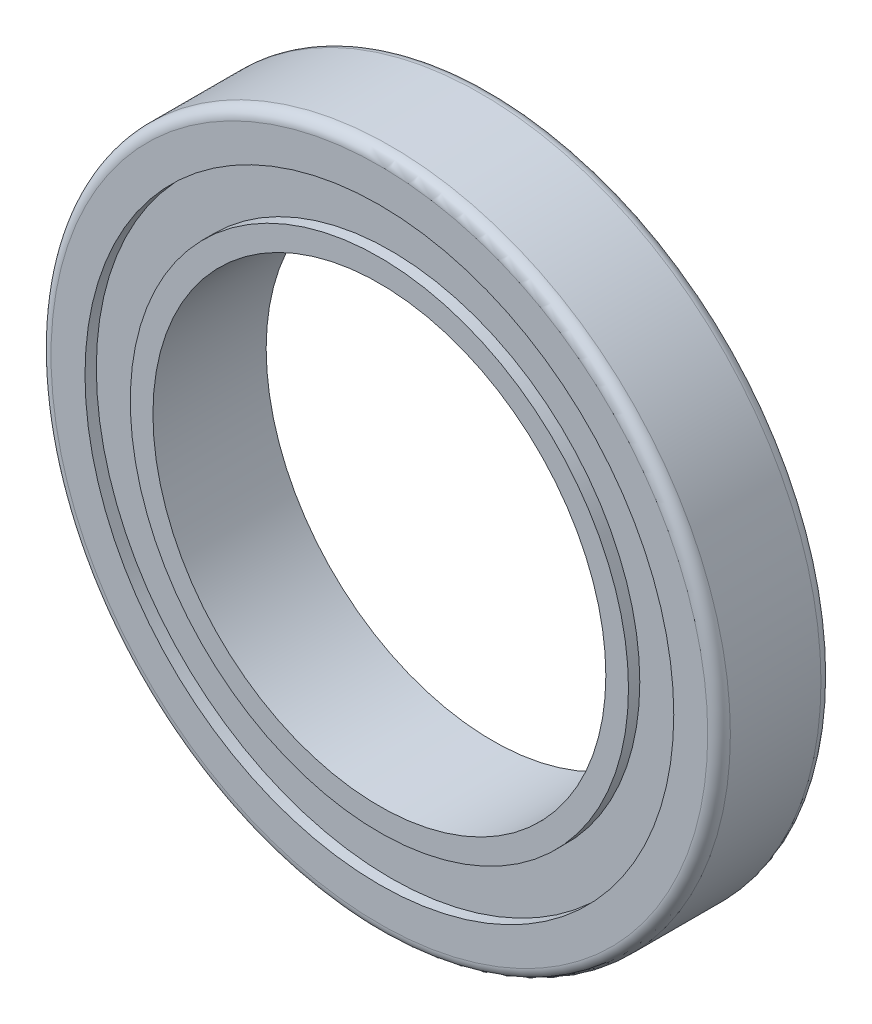
ISO-10303-21;
HEADER;
FILE_DESCRIPTION(('STEP AP214'),'2;1');
FILE_NAME('part.step','',(''),(''),'','','');
FILE_SCHEMA(('AUTOMOTIVE_DESIGN { 1 0 10303 214 1 1 1 1 }'));
ENDSEC;
DATA;
#1=APPLICATION_CONTEXT('core data for automotive mechanical design processes');
#2=APPLICATION_PROTOCOL_DEFINITION('international standard','automotive_design',2000,#1);
#3=PRODUCT_CONTEXT('',#1,'mechanical');
#4=PRODUCT('Part','Part','',(#3));
#5=PRODUCT_RELATED_PRODUCT_CATEGORY('part','',(#4));
#6=PRODUCT_DEFINITION_FORMATION('','',#4);
#7=PRODUCT_DEFINITION_CONTEXT('part definition',#1,'design');
#8=PRODUCT_DEFINITION('design','',#6,#7);
#9=PRODUCT_DEFINITION_SHAPE('','',#8);
#10=(LENGTH_UNIT() NAMED_UNIT(*) SI_UNIT(.MILLI.,.METRE.));
#11=(NAMED_UNIT(*) PLANE_ANGLE_UNIT() SI_UNIT($,.RADIAN.));
#12=(NAMED_UNIT(*) SI_UNIT($,.STERADIAN.) SOLID_ANGLE_UNIT());
#13=UNCERTAINTY_MEASURE_WITH_UNIT(LENGTH_MEASURE(1.E-05),#10,'distance_accuracy_value','');
#14=(GEOMETRIC_REPRESENTATION_CONTEXT(3) GLOBAL_UNCERTAINTY_ASSIGNED_CONTEXT((#13)) GLOBAL_UNIT_ASSIGNED_CONTEXT((#10,
#11,#12)) REPRESENTATION_CONTEXT('',''));
#15=CARTESIAN_POINT('',(0.,0.,0.));
#16=DIRECTION('',(0.,0.,1.));
#17=DIRECTION('',(1.,0.,0.));
#18=AXIS2_PLACEMENT_3D('',#15,#16,#17);
#19=CARTESIAN_POINT('',(0.,1.58418091123838,0.));
#20=DIRECTION('',(0.,0.,1.));
#21=DIRECTION('',(1.,0.,0.));
#22=AXIS2_PLACEMENT_3D('',#19,#20,#21);
#23=PLANE('',#22);
#24=CARTESIAN_POINT('',(0.,1.58418091123838,0.));
#25=DIRECTION('',(0.,0.,1.));
#26=DIRECTION('',(1.,0.,0.));
#27=AXIS2_PLACEMENT_3D('',#24,#25,#26);
#28=CIRCLE('',#27,10.);
#29=CARTESIAN_POINT('',(10.,1.58418091123838,0.));
#30=VERTEX_POINT('',#29);
#31=EDGE_CURVE('E51',#30,#30,#28,.T.);
#32=ORIENTED_EDGE('',*,*,#31,.T.);
#33=EDGE_LOOP('',(#32));
#34=FACE_BOUND('',#33,.T.);
#35=CARTESIAN_POINT('',(0.,1.58418091123838,0.));
#36=DIRECTION('',(0.,0.,-1.));
#37=DIRECTION('',(-1.,0.,0.));
#38=AXIS2_PLACEMENT_3D('',#35,#36,#37);
#39=CIRCLE('',#38,11.);
#40=CARTESIAN_POINT('',(-11.,1.58418091123838,0.));
#41=VERTEX_POINT('',#40);
#42=EDGE_CURVE('E75',#41,#41,#39,.T.);
#43=ORIENTED_EDGE('',*,*,#42,.T.);
#44=EDGE_LOOP('',(#43));
#45=FACE_BOUND('',#44,.T.);
#46=ADVANCED_FACE('F30',(#34,#45),#23,.F.);
#47=CARTESIAN_POINT('',(0.,1.58418091123838,5.));
#48=DIRECTION('',(0.,0.,1.));
#49=DIRECTION('',(1.,0.,0.));
#50=AXIS2_PLACEMENT_3D('',#47,#48,#49);
#51=PLANE('',#50);
#52=CARTESIAN_POINT('',(0.,1.58418091123838,5.));
#53=DIRECTION('',(0.,0.,1.));
#54=DIRECTION('',(1.,0.,0.));
#55=AXIS2_PLACEMENT_3D('',#52,#53,#54);
#56=CIRCLE('',#55,10.);
#57=CARTESIAN_POINT('',(10.,1.58418091123838,5.));
#58=VERTEX_POINT('',#57);
#59=EDGE_CURVE('E50',#58,#58,#56,.T.);
#60=ORIENTED_EDGE('',*,*,#59,.F.);
#61=EDGE_LOOP('',(#60));
#62=FACE_BOUND('',#61,.T.);
#63=CARTESIAN_POINT('',(0.,1.58418091123838,5.));
#64=DIRECTION('',(0.,0.,1.));
#65=DIRECTION('',(1.,0.,0.));
#66=AXIS2_PLACEMENT_3D('',#63,#64,#65);
#67=CIRCLE('',#66,11.);
#68=CARTESIAN_POINT('',(11.,1.58418091123838,5.));
#69=VERTEX_POINT('',#68);
#70=EDGE_CURVE('E63',#69,#69,#67,.T.);
#71=ORIENTED_EDGE('',*,*,#70,.T.);
#72=EDGE_LOOP('',(#71));
#73=FACE_BOUND('',#72,.T.);
#74=ADVANCED_FACE('F109',(#62,#73),#51,.T.);
#75=CARTESIAN_POINT('',(0.,1.58418091123838,5.));
#76=DIRECTION('',(0.,0.,1.));
#77=DIRECTION('',(1.,0.,0.));
#78=AXIS2_PLACEMENT_3D('',#75,#76,#77);
#79=CIRCLE('',#78,13.);
#80=CARTESIAN_POINT('',(13.,1.58418091123838,5.));
#81=VERTEX_POINT('',#80);
#82=EDGE_CURVE('E57',#81,#81,#79,.T.);
#83=ORIENTED_EDGE('',*,*,#82,.F.);
#84=EDGE_LOOP('',(#83));
#85=FACE_BOUND('',#84,.T.);
#86=CARTESIAN_POINT('',(0.,1.58418091123838,5.));
#87=DIRECTION('',(0.,0.,1.));
#88=DIRECTION('',(1.,0.,0.));
#89=AXIS2_PLACEMENT_3D('',#86,#87,#88);
#90=CIRCLE('',#89,14.5);
#91=CARTESIAN_POINT('',(14.5,1.58418091123838,5.));
#92=VERTEX_POINT('',#91);
#93=EDGE_CURVE('E10',#92,#92,#90,.T.);
#94=ORIENTED_EDGE('',*,*,#93,.T.);
#95=EDGE_LOOP('',(#94));
#96=FACE_BOUND('',#95,.T.);
#97=ADVANCED_FACE('F100',(#85,#96),#51,.T.);
#98=CARTESIAN_POINT('',(0.,1.58418091123838,0.));
#99=DIRECTION('',(0.,0.,-1.));
#100=DIRECTION('',(-1.,0.,0.));
#101=AXIS2_PLACEMENT_3D('',#98,#99,#100);
#102=CIRCLE('',#101,13.);
#103=CARTESIAN_POINT('',(-13.,1.58418091123838,0.));
#104=VERTEX_POINT('',#103);
#105=EDGE_CURVE('E69',#104,#104,#102,.T.);
#106=ORIENTED_EDGE('',*,*,#105,.F.);
#107=EDGE_LOOP('',(#106));
#108=FACE_BOUND('',#107,.T.);
#109=CARTESIAN_POINT('',(0.,1.58418091123838,0.));
#110=DIRECTION('',(0.,0.,1.));
#111=DIRECTION('',(1.,0.,0.));
#112=AXIS2_PLACEMENT_3D('',#109,#110,#111);
#113=CIRCLE('',#112,14.5);
#114=CARTESIAN_POINT('',(14.5,1.58418091123838,0.));
#115=VERTEX_POINT('',#114);
#116=EDGE_CURVE('E37',#115,#115,#113,.F.);
#117=ORIENTED_EDGE('',*,*,#116,.T.);
#118=EDGE_LOOP('',(#117));
#119=FACE_BOUND('',#118,.T.);
#120=ADVANCED_FACE('F97',(#108,#119),#23,.F.);
#121=CARTESIAN_POINT('',(0.,1.58418091123838,5.));
#122=DIRECTION('',(0.,0.,-1.));
#123=DIRECTION('',(-1.,0.,0.));
#124=AXIS2_PLACEMENT_3D('',#121,#122,#123);
#125=CYLINDRICAL_SURFACE('',#124,15.);
#126=CARTESIAN_POINT('',(0.,1.58418091123838,0.5));
#127=DIRECTION('',(0.,0.,1.));
#128=DIRECTION('',(1.,0.,0.));
#129=AXIS2_PLACEMENT_3D('',#126,#127,#128);
#130=CIRCLE('',#129,15.);
#131=CARTESIAN_POINT('',(15.,1.58418091123838,0.5));
#132=VERTEX_POINT('',#131);
#133=EDGE_CURVE('E41',#132,#132,#130,.T.);
#134=ORIENTED_EDGE('',*,*,#133,.T.);
#135=EDGE_LOOP('',(#134));
#136=FACE_BOUND('',#135,.T.);
#137=CARTESIAN_POINT('',(0.,1.58418091123838,4.5));
#138=DIRECTION('',(0.,0.,1.));
#139=DIRECTION('',(1.,0.,0.));
#140=AXIS2_PLACEMENT_3D('',#137,#138,#139);
#141=CIRCLE('',#140,15.);
#142=CARTESIAN_POINT('',(15.,1.58418091123838,4.5));
#143=VERTEX_POINT('',#142);
#144=EDGE_CURVE('E45',#143,#143,#141,.F.);
#145=ORIENTED_EDGE('',*,*,#144,.T.);
#146=EDGE_LOOP('',(#145));
#147=FACE_BOUND('',#146,.T.);
#148=ADVANCED_FACE('F99',(#136,#147),#125,.T.);
#149=CARTESIAN_POINT('',(0.,1.58418091123838,5.));
#150=DIRECTION('',(0.,0.,-1.));
#151=DIRECTION('',(-1.,0.,0.));
#152=AXIS2_PLACEMENT_3D('',#149,#150,#151);
#153=CYLINDRICAL_SURFACE('',#152,10.);
#154=ORIENTED_EDGE('',*,*,#59,.T.);
#155=EDGE_LOOP('',(#154));
#156=FACE_BOUND('',#155,.T.);
#157=ORIENTED_EDGE('',*,*,#31,.F.);
#158=EDGE_LOOP('',(#157));
#159=FACE_BOUND('',#158,.T.);
#160=ADVANCED_FACE('F106',(#156,#159),#153,.F.);
#161=CARTESIAN_POINT('',(0.,1.58418091123838,0.5));
#162=DIRECTION('',(0.,0.,1.));
#163=DIRECTION('',(1.,0.,0.));
#164=AXIS2_PLACEMENT_3D('',#161,#162,#163);
#165=TOROIDAL_SURFACE('',#164,14.5,0.5);
#166=ORIENTED_EDGE('',*,*,#116,.F.);
#167=EDGE_LOOP('',(#166));
#168=FACE_BOUND('',#167,.T.);
#169=ORIENTED_EDGE('',*,*,#133,.F.);
#170=EDGE_LOOP('',(#169));
#171=FACE_BOUND('',#170,.T.);
#172=ADVANCED_FACE('F138',(#168,#171),#165,.T.);
#173=CARTESIAN_POINT('',(0.,1.58418091123838,4.5));
#174=DIRECTION('',(0.,0.,1.));
#175=DIRECTION('',(1.,0.,0.));
#176=AXIS2_PLACEMENT_3D('',#173,#174,#175);
#177=TOROIDAL_SURFACE('',#176,14.5,0.5);
#178=ORIENTED_EDGE('',*,*,#144,.F.);
#179=EDGE_LOOP('',(#178));
#180=FACE_BOUND('',#179,.T.);
#181=ORIENTED_EDGE('',*,*,#93,.F.);
#182=EDGE_LOOP('',(#181));
#183=FACE_BOUND('',#182,.T.);
#184=ADVANCED_FACE('F32',(#180,#183),#177,.T.);
#185=CARTESIAN_POINT('',(0.,1.58418091123838,4.5));
#186=DIRECTION('',(0.,0.,1.));
#187=DIRECTION('',(1.,0.,0.));
#188=AXIS2_PLACEMENT_3D('',#185,#186,#187);
#189=CYLINDRICAL_SURFACE('',#188,13.);
#190=CARTESIAN_POINT('',(0.,1.58418091123838,4.5));
#191=DIRECTION('',(0.,0.,1.));
#192=DIRECTION('',(1.,0.,0.));
#193=AXIS2_PLACEMENT_3D('',#190,#191,#192);
#194=CIRCLE('',#193,13.);
#195=CARTESIAN_POINT('',(13.,1.58418091123838,4.5));
#196=VERTEX_POINT('',#195);
#197=EDGE_CURVE('E54',#196,#196,#194,.T.);
#198=ORIENTED_EDGE('',*,*,#197,.F.);
#199=EDGE_LOOP('',(#198));
#200=FACE_BOUND('',#199,.T.);
#201=ORIENTED_EDGE('',*,*,#82,.T.);
#202=EDGE_LOOP('',(#201));
#203=FACE_BOUND('',#202,.T.);
#204=ADVANCED_FACE('F132',(#200,#203),#189,.F.);
#205=CARTESIAN_POINT('',(0.,1.58418091123838,4.5));
#206=DIRECTION('',(0.,0.,1.));
#207=DIRECTION('',(1.,0.,0.));
#208=AXIS2_PLACEMENT_3D('',#205,#206,#207);
#209=PLANE('',#208);
#210=CARTESIAN_POINT('',(0.,1.58418091123838,4.5));
#211=DIRECTION('',(0.,0.,1.));
#212=DIRECTION('',(1.,0.,0.));
#213=AXIS2_PLACEMENT_3D('',#210,#211,#212);
#214=CIRCLE('',#213,11.);
#215=CARTESIAN_POINT('',(11.,1.58418091123838,4.5));
#216=VERTEX_POINT('',#215);
#217=EDGE_CURVE('E60',#216,#216,#214,.T.);
#218=ORIENTED_EDGE('',*,*,#217,.F.);
#219=EDGE_LOOP('',(#218));
#220=FACE_BOUND('',#219,.T.);
#221=ORIENTED_EDGE('',*,*,#197,.T.);
#222=EDGE_LOOP('',(#221));
#223=FACE_BOUND('',#222,.T.);
#224=ADVANCED_FACE('F128',(#220,#223),#209,.T.);
#225=CARTESIAN_POINT('',(0.,1.58418091123838,4.5));
#226=DIRECTION('',(0.,0.,1.));
#227=DIRECTION('',(1.,0.,0.));
#228=AXIS2_PLACEMENT_3D('',#225,#226,#227);
#229=CYLINDRICAL_SURFACE('',#228,11.);
#230=ORIENTED_EDGE('',*,*,#217,.T.);
#231=EDGE_LOOP('',(#230));
#232=FACE_BOUND('',#231,.T.);
#233=ORIENTED_EDGE('',*,*,#70,.F.);
#234=EDGE_LOOP('',(#233));
#235=FACE_BOUND('',#234,.T.);
#236=ADVANCED_FACE('F93',(#232,#235),#229,.T.);
#237=CARTESIAN_POINT('',(0.,1.58418091123838,0.5));
#238=DIRECTION('',(0.,0.,-1.));
#239=DIRECTION('',(-1.,0.,0.));
#240=AXIS2_PLACEMENT_3D('',#237,#238,#239);
#241=CYLINDRICAL_SURFACE('',#240,13.);
#242=CARTESIAN_POINT('',(0.,1.58418091123838,0.5));
#243=DIRECTION('',(0.,0.,-1.));
#244=DIRECTION('',(-1.,0.,0.));
#245=AXIS2_PLACEMENT_3D('',#242,#243,#244);
#246=CIRCLE('',#245,13.);
#247=CARTESIAN_POINT('',(-13.,1.58418091123838,0.5));
#248=VERTEX_POINT('',#247);
#249=EDGE_CURVE('E66',#248,#248,#246,.T.);
#250=ORIENTED_EDGE('',*,*,#249,.F.);
#251=EDGE_LOOP('',(#250));
#252=FACE_BOUND('',#251,.T.);
#253=ORIENTED_EDGE('',*,*,#105,.T.);
#254=EDGE_LOOP('',(#253));
#255=FACE_BOUND('',#254,.T.);
#256=ADVANCED_FACE('F87',(#252,#255),#241,.F.);
#257=CARTESIAN_POINT('',(0.,1.58418091123838,0.5));
#258=DIRECTION('',(0.,0.,-1.));
#259=DIRECTION('',(-1.,0.,0.));
#260=AXIS2_PLACEMENT_3D('',#257,#258,#259);
#261=PLANE('',#260);
#262=CARTESIAN_POINT('',(0.,1.58418091123838,0.5));
#263=DIRECTION('',(0.,0.,-1.));
#264=DIRECTION('',(-1.,0.,0.));
#265=AXIS2_PLACEMENT_3D('',#262,#263,#264);
#266=CIRCLE('',#265,11.);
#267=CARTESIAN_POINT('',(-11.,1.58418091123838,0.5));
#268=VERTEX_POINT('',#267);
#269=EDGE_CURVE('E72',#268,#268,#266,.T.);
#270=ORIENTED_EDGE('',*,*,#269,.F.);
#271=EDGE_LOOP('',(#270));
#272=FACE_BOUND('',#271,.T.);
#273=ORIENTED_EDGE('',*,*,#249,.T.);
#274=EDGE_LOOP('',(#273));
#275=FACE_BOUND('',#274,.T.);
#276=ADVANCED_FACE('F84',(#272,#275),#261,.T.);
#277=CARTESIAN_POINT('',(0.,1.58418091123838,0.5));
#278=DIRECTION('',(0.,0.,-1.));
#279=DIRECTION('',(-1.,0.,0.));
#280=AXIS2_PLACEMENT_3D('',#277,#278,#279);
#281=CYLINDRICAL_SURFACE('',#280,11.);
#282=ORIENTED_EDGE('',*,*,#269,.T.);
#283=EDGE_LOOP('',(#282));
#284=FACE_BOUND('',#283,.T.);
#285=ORIENTED_EDGE('',*,*,#42,.F.);
#286=EDGE_LOOP('',(#285));
#287=FACE_BOUND('',#286,.T.);
#288=ADVANCED_FACE('F81',(#284,#287),#281,.T.);
#289=CLOSED_SHELL('',(#46,#74,#97,#120,#148,#160,#172,#184,#204,#224,#236,#256,#276,#288));
#290=MANIFOLD_SOLID_BREP('B2',#289);
#291=ADVANCED_BREP_SHAPE_REPRESENTATION('',(#18,#290),#14);
#292=SHAPE_DEFINITION_REPRESENTATION(#9,#291);
ENDSEC;
END-ISO-10303-21;
